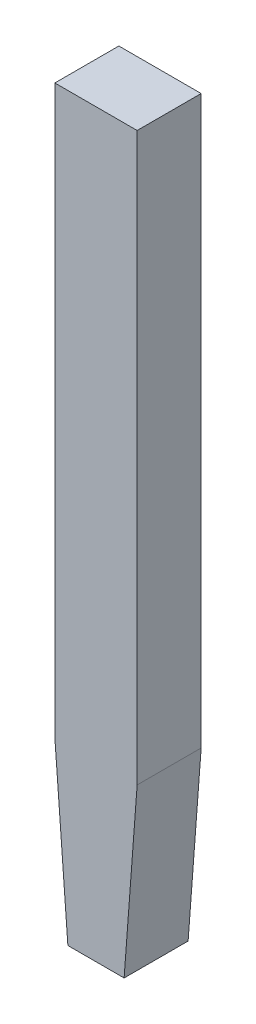
ISO-10303-21;
HEADER;
FILE_DESCRIPTION(('STEP AP214'),'2;1');
FILE_NAME('part.step','',(''),(''),'','','');
FILE_SCHEMA(('AUTOMOTIVE_DESIGN { 1 0 10303 214 1 1 1 1 }'));
ENDSEC;
DATA;
#1=APPLICATION_CONTEXT('core data for automotive mechanical design processes');
#2=APPLICATION_PROTOCOL_DEFINITION('international standard','automotive_design',2000,#1);
#3=PRODUCT_CONTEXT('',#1,'mechanical');
#4=PRODUCT('Part','Part','',(#3));
#5=PRODUCT_RELATED_PRODUCT_CATEGORY('part','',(#4));
#6=PRODUCT_DEFINITION_FORMATION('','',#4);
#7=PRODUCT_DEFINITION_CONTEXT('part definition',#1,'design');
#8=PRODUCT_DEFINITION('design','',#6,#7);
#9=PRODUCT_DEFINITION_SHAPE('','',#8);
#10=(LENGTH_UNIT() NAMED_UNIT(*) SI_UNIT(.MILLI.,.METRE.));
#11=(NAMED_UNIT(*) PLANE_ANGLE_UNIT() SI_UNIT($,.RADIAN.));
#12=(NAMED_UNIT(*) SI_UNIT($,.STERADIAN.) SOLID_ANGLE_UNIT());
#13=UNCERTAINTY_MEASURE_WITH_UNIT(LENGTH_MEASURE(1.E-05),#10,'distance_accuracy_value','');
#14=(GEOMETRIC_REPRESENTATION_CONTEXT(3) GLOBAL_UNCERTAINTY_ASSIGNED_CONTEXT((#13)) GLOBAL_UNIT_ASSIGNED_CONTEXT((#10,
#11,#12)) REPRESENTATION_CONTEXT('',''));
#15=CARTESIAN_POINT('',(0.,0.,0.));
#16=DIRECTION('',(0.,0.,1.));
#17=DIRECTION('',(1.,0.,0.));
#18=AXIS2_PLACEMENT_3D('',#15,#16,#17);
#19=CARTESIAN_POINT('',(55.49457889831,-0.5212621897839,0.8150000000459));
#20=DIRECTION('',(0.,0.,1.));
#21=DIRECTION('',(1.,0.,0.));
#22=AXIS2_PLACEMENT_3D('',#19,#20,#21);
#23=PLANE('',#22);
#24=DIRECTION('',(0.0747899482416288,0.997199309888457,0.));
#25=VECTOR('',#24,1.);
#26=CARTESIAN_POINT('',(56.09832889831,-15.17126218978,0.8150000000459));
#27=LINE('',#26,#25);
#28=CARTESIAN_POINT('',(56.09832889831,-15.17126218978,0.8150000000459));
#29=VERTEX_POINT('',#28);
#30=CARTESIAN_POINT('',(56.16957889831,-14.22126218978,0.8150000000459));
#31=VERTEX_POINT('',#30);
#32=EDGE_CURVE('E83',#29,#31,#27,.T.);
#33=ORIENTED_EDGE('',*,*,#32,.F.);
#34=DIRECTION('',(1.,0.,0.));
#35=VECTOR('',#34,1.);
#36=CARTESIAN_POINT('',(55.49457889831,-15.17126218978,0.8150000000459));
#37=LINE('',#36,#35);
#38=CARTESIAN_POINT('',(55.79082889831,-15.17126218978,0.8150000000459));
#39=VERTEX_POINT('',#38);
#40=EDGE_CURVE('E66',#39,#29,#37,.T.);
#41=ORIENTED_EDGE('',*,*,#40,.F.);
#42=DIRECTION('',(0.0747899482416288,-0.997199309888457,0.));
#43=VECTOR('',#42,1.);
#44=CARTESIAN_POINT('',(55.71957889831,-14.22126218978,0.8150000000459));
#45=LINE('',#44,#43);
#46=CARTESIAN_POINT('',(55.71957889831,-14.2212621897802,0.8150000000459));
#47=VERTEX_POINT('',#46);
#48=EDGE_CURVE('E20',#47,#39,#45,.T.);
#49=ORIENTED_EDGE('',*,*,#48,.F.);
#50=DIRECTION('',(0.,1.,0.));
#51=VECTOR('',#50,1.);
#52=CARTESIAN_POINT('',(55.71957889831,-7.321262189784,0.8150000000459));
#53=LINE('',#52,#51);
#54=CARTESIAN_POINT('',(55.71957889831,-11.12202888849,0.8150000000459));
#55=VERTEX_POINT('',#54);
#56=EDGE_CURVE('E96',#55,#47,#53,.F.);
#57=ORIENTED_EDGE('',*,*,#56,.F.);
#58=DIRECTION('',(1.,0.,0.));
#59=VECTOR('',#58,1.);
#60=CARTESIAN_POINT('',(44.47457889831,-11.12202888849,0.8150000000459));
#61=LINE('',#60,#59);
#62=CARTESIAN_POINT('',(56.16957889831,-11.12202888849,0.8150000000459));
#63=VERTEX_POINT('',#62);
#64=EDGE_CURVE('E89',#55,#63,#61,.T.);
#65=ORIENTED_EDGE('',*,*,#64,.T.);
#66=DIRECTION('',(0.,1.,0.));
#67=VECTOR('',#66,1.);
#68=CARTESIAN_POINT('',(56.16957889831,-7.321262189784,0.8150000000459));
#69=LINE('',#68,#67);
#70=EDGE_CURVE('E84',#31,#63,#69,.T.);
#71=ORIENTED_EDGE('',*,*,#70,.F.);
#72=EDGE_LOOP('',(#33,#41,#49,#57,#65,#71));
#73=FACE_BOUND('',#72,.T.);
#74=ADVANCED_FACE('F17',(#73),#23,.F.);
#75=CARTESIAN_POINT('',(56.16957889831,-7.321262189784,0.8150000000459));
#76=DIRECTION('',(1.,0.,0.));
#77=DIRECTION('',(0.,0.,-1.));
#78=AXIS2_PLACEMENT_3D('',#75,#76,#77);
#79=PLANE('',#78);
#80=DIRECTION('',(0.,1.,0.));
#81=VECTOR('',#80,1.);
#82=CARTESIAN_POINT('',(56.16957889831,-0.5212621897839,1.165000000046));
#83=LINE('',#82,#81);
#84=CARTESIAN_POINT('',(56.16957889831,-14.22126218978,1.165000000046));
#85=VERTEX_POINT('',#84);
#86=CARTESIAN_POINT('',(56.16957889831,-11.12202888849,1.165000000046));
#87=VERTEX_POINT('',#86);
#88=EDGE_CURVE('E103',#85,#87,#83,.T.);
#89=ORIENTED_EDGE('',*,*,#88,.F.);
#90=DIRECTION('',(0.,0.,1.));
#91=VECTOR('',#90,1.);
#92=CARTESIAN_POINT('',(56.16957889831,-14.22126218978,0.8150000000459));
#93=LINE('',#92,#91);
#94=EDGE_CURVE('E100',#31,#85,#93,.T.);
#95=ORIENTED_EDGE('',*,*,#94,.F.);
#96=ORIENTED_EDGE('',*,*,#70,.T.);
#97=DIRECTION('',(0.,0.,-1.));
#98=VECTOR('',#97,1.);
#99=CARTESIAN_POINT('',(56.16957889831,-11.12202888849,-0.158278306686));
#100=LINE('',#99,#98);
#101=EDGE_CURVE('E91',#63,#87,#100,.F.);
#102=ORIENTED_EDGE('',*,*,#101,.T.);
#103=EDGE_LOOP('',(#89,#95,#96,#102));
#104=FACE_BOUND('',#103,.T.);
#105=ADVANCED_FACE('F124',(#104),#79,.T.);
#106=CARTESIAN_POINT('',(44.47457889831,-11.12202888849,-0.158278306686));
#107=DIRECTION('',(0.,-1.,0.));
#108=DIRECTION('',(0.,0.,-1.));
#109=AXIS2_PLACEMENT_3D('',#106,#107,#108);
#110=PLANE('',#109);
#111=ORIENTED_EDGE('',*,*,#64,.F.);
#112=DIRECTION('',(0.,0.,1.));
#113=VECTOR('',#112,1.);
#114=CARTESIAN_POINT('',(55.71957889831,-11.12202888849,0.8150000000459));
#115=LINE('',#114,#113);
#116=CARTESIAN_POINT('',(55.71957889831,-11.12202888849,1.165000000046));
#117=VERTEX_POINT('',#116);
#118=EDGE_CURVE('E93',#117,#55,#115,.F.);
#119=ORIENTED_EDGE('',*,*,#118,.F.);
#120=DIRECTION('',(1.,0.,0.));
#121=VECTOR('',#120,1.);
#122=CARTESIAN_POINT('',(55.49457889831,-11.12202888849,1.165000000046));
#123=LINE('',#122,#121);
#124=EDGE_CURVE('E106',#87,#117,#123,.F.);
#125=ORIENTED_EDGE('',*,*,#124,.F.);
#126=ORIENTED_EDGE('',*,*,#101,.F.);
#127=EDGE_LOOP('',(#111,#119,#125,#126));
#128=FACE_BOUND('',#127,.T.);
#129=ADVANCED_FACE('F125',(#128),#110,.F.);
#130=CARTESIAN_POINT('',(55.71957889831,-7.321262189784,0.8150000000459));
#131=DIRECTION('',(-1.,0.,0.));
#132=DIRECTION('',(0.,0.,1.));
#133=AXIS2_PLACEMENT_3D('',#130,#131,#132);
#134=PLANE('',#133);
#135=ORIENTED_EDGE('',*,*,#56,.T.);
#136=DIRECTION('',(0.,0.,1.));
#137=VECTOR('',#136,1.);
#138=CARTESIAN_POINT('',(55.71957889831,-14.22126218978,0.8150000000459));
#139=LINE('',#138,#137);
#140=CARTESIAN_POINT('',(55.71957889831,-14.2212621897801,1.165000000046));
#141=VERTEX_POINT('',#140);
#142=EDGE_CURVE('E73',#141,#47,#139,.F.);
#143=ORIENTED_EDGE('',*,*,#142,.F.);
#144=DIRECTION('',(0.,1.,0.));
#145=VECTOR('',#144,1.);
#146=CARTESIAN_POINT('',(55.71957889831,-0.5212621897839,1.165000000046));
#147=LINE('',#146,#145);
#148=EDGE_CURVE('E109',#117,#141,#147,.F.);
#149=ORIENTED_EDGE('',*,*,#148,.F.);
#150=ORIENTED_EDGE('',*,*,#118,.T.);
#151=EDGE_LOOP('',(#135,#143,#149,#150));
#152=FACE_BOUND('',#151,.T.);
#153=ADVANCED_FACE('F119',(#152),#134,.T.);
#154=CARTESIAN_POINT('',(55.71957889831,-14.22126218978,0.8150000000459));
#155=DIRECTION('',(-0.997199309888458,-0.0747899482416168,0.));
#156=DIRECTION('',(0.0747899482416168,-0.997199309888458,0.));
#157=AXIS2_PLACEMENT_3D('',#154,#155,#156);
#158=PLANE('',#157);
#159=DIRECTION('',(0.0747899482416288,-0.997199309888457,0.));
#160=VECTOR('',#159,1.);
#161=CARTESIAN_POINT('',(55.71957889831,-14.22126218978,1.165000000046));
#162=LINE('',#161,#160);
#163=CARTESIAN_POINT('',(55.79082889831,-15.17126218978,1.165000000046));
#164=VERTEX_POINT('',#163);
#165=EDGE_CURVE('E112',#141,#164,#162,.T.);
#166=ORIENTED_EDGE('',*,*,#165,.F.);
#167=ORIENTED_EDGE('',*,*,#142,.T.);
#168=ORIENTED_EDGE('',*,*,#48,.T.);
#169=DIRECTION('',(0.,0.,1.));
#170=VECTOR('',#169,1.);
#171=CARTESIAN_POINT('',(55.79082889831,-15.17126218978,-0.8137967800219));
#172=LINE('',#171,#170);
#173=EDGE_CURVE('E72',#39,#164,#172,.T.);
#174=ORIENTED_EDGE('',*,*,#173,.T.);
#175=EDGE_LOOP('',(#166,#167,#168,#174));
#176=FACE_BOUND('',#175,.T.);
#177=ADVANCED_FACE('F71',(#176),#158,.T.);
#178=CARTESIAN_POINT('',(38.93957889831,-15.17126218978,-0.8137967800219));
#179=DIRECTION('',(0.,1.,0.));
#180=DIRECTION('',(0.,0.,1.));
#181=AXIS2_PLACEMENT_3D('',#178,#179,#180);
#182=PLANE('',#181);
#183=ORIENTED_EDGE('',*,*,#40,.T.);
#184=DIRECTION('',(0.,0.,1.));
#185=VECTOR('',#184,1.);
#186=CARTESIAN_POINT('',(56.09832889831,-15.17126218978,0.8150000000459));
#187=LINE('',#186,#185);
#188=CARTESIAN_POINT('',(56.09832889831,-15.17126218978,1.165000000046));
#189=VERTEX_POINT('',#188);
#190=EDGE_CURVE('E35',#189,#29,#187,.F.);
#191=ORIENTED_EDGE('',*,*,#190,.F.);
#192=DIRECTION('',(1.,0.,0.));
#193=VECTOR('',#192,1.);
#194=CARTESIAN_POINT('',(55.49457889831,-15.17126218978,1.165000000046));
#195=LINE('',#194,#193);
#196=EDGE_CURVE('E26',#164,#189,#195,.T.);
#197=ORIENTED_EDGE('',*,*,#196,.F.);
#198=ORIENTED_EDGE('',*,*,#173,.F.);
#199=EDGE_LOOP('',(#183,#191,#197,#198));
#200=FACE_BOUND('',#199,.T.);
#201=ADVANCED_FACE('F77',(#200),#182,.F.);
#202=CARTESIAN_POINT('',(56.16957889831,-14.22126218978,0.8150000000459));
#203=DIRECTION('',(0.997199309888458,-0.0747899482416168,0.));
#204=DIRECTION('',(0.0747899482416168,0.997199309888458,0.));
#205=AXIS2_PLACEMENT_3D('',#202,#203,#204);
#206=PLANE('',#205);
#207=ORIENTED_EDGE('',*,*,#32,.T.);
#208=ORIENTED_EDGE('',*,*,#94,.T.);
#209=DIRECTION('',(0.0747899482416288,0.997199309888457,0.));
#210=VECTOR('',#209,1.);
#211=CARTESIAN_POINT('',(56.09832889831,-15.17126218978,1.165000000046));
#212=LINE('',#211,#210);
#213=EDGE_CURVE('E11',#189,#85,#212,.T.);
#214=ORIENTED_EDGE('',*,*,#213,.F.);
#215=ORIENTED_EDGE('',*,*,#190,.T.);
#216=EDGE_LOOP('',(#207,#208,#214,#215));
#217=FACE_BOUND('',#216,.T.);
#218=ADVANCED_FACE('F127',(#217),#206,.T.);
#219=CARTESIAN_POINT('',(55.49457889831,-0.5212621897839,1.165000000046));
#220=DIRECTION('',(0.,0.,1.));
#221=DIRECTION('',(1.,0.,0.));
#222=AXIS2_PLACEMENT_3D('',#219,#220,#221);
#223=PLANE('',#222);
#224=ORIENTED_EDGE('',*,*,#196,.T.);
#225=ORIENTED_EDGE('',*,*,#213,.T.);
#226=ORIENTED_EDGE('',*,*,#88,.T.);
#227=ORIENTED_EDGE('',*,*,#124,.T.);
#228=ORIENTED_EDGE('',*,*,#148,.T.);
#229=ORIENTED_EDGE('',*,*,#165,.T.);
#230=EDGE_LOOP('',(#224,#225,#226,#227,#228,#229));
#231=FACE_BOUND('',#230,.T.);
#232=ADVANCED_FACE('F115',(#231),#223,.T.);
#233=CLOSED_SHELL('',(#74,#105,#129,#153,#177,#201,#218,#232));
#234=MANIFOLD_SOLID_BREP('B1',#233);
#235=ADVANCED_BREP_SHAPE_REPRESENTATION('',(#18,#234),#14);
#236=SHAPE_DEFINITION_REPRESENTATION(#9,#235);
ENDSEC;
END-ISO-10303-21;
